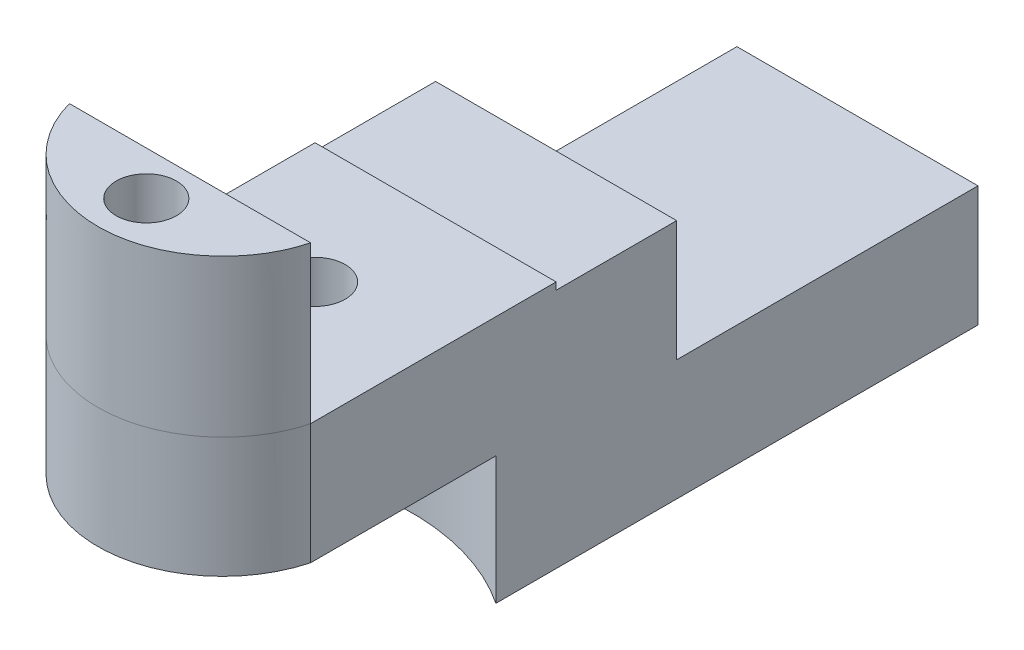
ISO-10303-21;
HEADER;
FILE_DESCRIPTION(('STEP AP214'),'2;1');
FILE_NAME('part.step','',(''),(''),'','','');
FILE_SCHEMA(('AUTOMOTIVE_DESIGN { 1 0 10303 214 1 1 1 1 }'));
ENDSEC;
DATA;
#1=APPLICATION_CONTEXT('core data for automotive mechanical design processes');
#2=APPLICATION_PROTOCOL_DEFINITION('international standard','automotive_design',2000,#1);
#3=PRODUCT_CONTEXT('',#1,'mechanical');
#4=PRODUCT('Part','Part','',(#3));
#5=PRODUCT_RELATED_PRODUCT_CATEGORY('part','',(#4));
#6=PRODUCT_DEFINITION_FORMATION('','',#4);
#7=PRODUCT_DEFINITION_CONTEXT('part definition',#1,'design');
#8=PRODUCT_DEFINITION('design','',#6,#7);
#9=PRODUCT_DEFINITION_SHAPE('','',#8);
#10=(LENGTH_UNIT() NAMED_UNIT(*) SI_UNIT(.MILLI.,.METRE.));
#11=(NAMED_UNIT(*) PLANE_ANGLE_UNIT() SI_UNIT($,.RADIAN.));
#12=(NAMED_UNIT(*) SI_UNIT($,.STERADIAN.) SOLID_ANGLE_UNIT());
#13=UNCERTAINTY_MEASURE_WITH_UNIT(LENGTH_MEASURE(1.E-05),#10,'distance_accuracy_value','');
#14=(GEOMETRIC_REPRESENTATION_CONTEXT(3) GLOBAL_UNCERTAINTY_ASSIGNED_CONTEXT((#13)) GLOBAL_UNIT_ASSIGNED_CONTEXT((#10,
#11,#12)) REPRESENTATION_CONTEXT('',''));
#15=CARTESIAN_POINT('',(0.,0.,0.));
#16=DIRECTION('',(0.,0.,1.));
#17=DIRECTION('',(1.,0.,0.));
#18=AXIS2_PLACEMENT_3D('',#15,#16,#17);
#19=CARTESIAN_POINT('',(0.,0.,-7.62));
#20=DIRECTION('',(0.,0.,1.));
#21=DIRECTION('',(1.,0.,0.));
#22=AXIS2_PLACEMENT_3D('',#19,#20,#21);
#23=PLANE('',#22);
#24=DIRECTION('',(1.,0.,0.));
#25=VECTOR('',#24,1.);
#26=CARTESIAN_POINT('',(2.54,-0.151815502330602,-7.62000000000001));
#27=LINE('',#26,#25);
#28=CARTESIAN_POINT('',(-2.54,-0.151815502330602,-7.62));
#29=VERTEX_POINT('',#28);
#30=CARTESIAN_POINT('',(2.54,-0.151815502330602,-7.62000000000001));
#31=VERTEX_POINT('',#30);
#32=EDGE_CURVE('E56',#29,#31,#27,.T.);
#33=ORIENTED_EDGE('',*,*,#32,.F.);
#34=DIRECTION('',(0.,1.,0.));
#35=VECTOR('',#34,1.);
#36=CARTESIAN_POINT('',(-2.54,-2.6918155023306,-7.62));
#37=LINE('',#36,#35);
#38=CARTESIAN_POINT('',(-2.54,2.3881844976694,-7.62));
#39=VERTEX_POINT('',#38);
#40=EDGE_CURVE('E180',#29,#39,#37,.T.);
#41=ORIENTED_EDGE('',*,*,#40,.T.);
#42=DIRECTION('',(1.,0.,0.));
#43=VECTOR('',#42,1.);
#44=CARTESIAN_POINT('',(2.54,2.3881844976694,-7.62000000000001));
#45=LINE('',#44,#43);
#46=CARTESIAN_POINT('',(2.54,2.3881844976694,-7.62000000000001));
#47=VERTEX_POINT('',#46);
#48=EDGE_CURVE('E182',#39,#47,#45,.T.);
#49=ORIENTED_EDGE('',*,*,#48,.T.);
#50=DIRECTION('',(0.,-1.,0.));
#51=VECTOR('',#50,1.);
#52=CARTESIAN_POINT('',(2.54,-2.6918155023306,-7.62000000000001));
#53=LINE('',#52,#51);
#54=EDGE_CURVE('E184',#47,#31,#53,.T.);
#55=ORIENTED_EDGE('',*,*,#54,.T.);
#56=EDGE_LOOP('',(#33,#41,#49,#55));
#57=FACE_BOUND('',#56,.T.);
#58=ADVANCED_FACE('F40',(#57),#23,.F.);
#59=CARTESIAN_POINT('',(0.,0.,-5.08));
#60=DIRECTION('',(0.,0.,1.));
#61=DIRECTION('',(1.,0.,0.));
#62=AXIS2_PLACEMENT_3D('',#59,#60,#61);
#63=PLANE('',#62);
#64=DIRECTION('',(1.,0.,0.));
#65=VECTOR('',#64,1.);
#66=CARTESIAN_POINT('',(2.54,2.3881844976694,-5.08));
#67=LINE('',#66,#65);
#68=CARTESIAN_POINT('',(-2.54,2.3881844976694,-5.08));
#69=VERTEX_POINT('',#68);
#70=CARTESIAN_POINT('',(2.54,2.3881844976694,-5.08));
#71=VERTEX_POINT('',#70);
#72=EDGE_CURVE('E64',#69,#71,#67,.T.);
#73=ORIENTED_EDGE('',*,*,#72,.F.);
#74=DIRECTION('',(0.,1.,0.));
#75=VECTOR('',#74,1.);
#76=CARTESIAN_POINT('',(-2.54,2.54,-5.08));
#77=LINE('',#76,#75);
#78=CARTESIAN_POINT('',(-2.54,2.54,-5.08));
#79=VERTEX_POINT('',#78);
#80=EDGE_CURVE('E201',#69,#79,#77,.T.);
#81=ORIENTED_EDGE('',*,*,#80,.T.);
#82=DIRECTION('',(1.,0.,0.));
#83=VECTOR('',#82,1.);
#84=CARTESIAN_POINT('',(-2.54,2.54,-5.08));
#85=LINE('',#84,#83);
#86=CARTESIAN_POINT('',(2.54,2.54,-5.08));
#87=VERTEX_POINT('',#86);
#88=EDGE_CURVE('E203',#79,#87,#85,.T.);
#89=ORIENTED_EDGE('',*,*,#88,.T.);
#90=DIRECTION('',(0.,-1.,0.));
#91=VECTOR('',#90,1.);
#92=CARTESIAN_POINT('',(2.54,2.54,-5.08));
#93=LINE('',#92,#91);
#94=EDGE_CURVE('E206',#87,#71,#93,.T.);
#95=ORIENTED_EDGE('',*,*,#94,.T.);
#96=EDGE_LOOP('',(#73,#81,#89,#95));
#97=FACE_BOUND('',#96,.T.);
#98=ADVANCED_FACE('F373',(#97),#63,.F.);
#99=CARTESIAN_POINT('',(1.27,0.,2.53999999999999));
#100=DIRECTION('',(0.,1.,0.));
#101=DIRECTION('',(0.,0.,1.));
#102=AXIS2_PLACEMENT_3D('',#99,#100,#101);
#103=PLANE('',#102);
#104=CARTESIAN_POINT('',(0.,0.,-2.54));
#105=DIRECTION('',(0.,1.,0.));
#106=DIRECTION('',(0.,0.,1.));
#107=AXIS2_PLACEMENT_3D('',#104,#105,#106);
#108=CIRCLE('',#107,0.635);
#109=CARTESIAN_POINT('',(0.,0.,-1.905));
#110=VERTEX_POINT('',#109);
#111=EDGE_CURVE('E298',#110,#110,#108,.T.);
#112=ORIENTED_EDGE('',*,*,#111,.T.);
#113=EDGE_LOOP('',(#112));
#114=FACE_BOUND('',#113,.T.);
#115=CARTESIAN_POINT('',(0.,0.,1.016));
#116=DIRECTION('',(0.,1.,0.));
#117=DIRECTION('',(0.,0.,1.));
#118=AXIS2_PLACEMENT_3D('',#115,#116,#117);
#119=CIRCLE('',#118,0.635);
#120=CARTESIAN_POINT('',(0.,0.,1.651));
#121=VERTEX_POINT('',#120);
#122=EDGE_CURVE('E295',#121,#121,#119,.T.);
#123=ORIENTED_EDGE('',*,*,#122,.T.);
#124=EDGE_LOOP('',(#123));
#125=FACE_BOUND('',#124,.T.);
#126=CARTESIAN_POINT('',(0.,0.,0.));
#127=DIRECTION('',(0.,-1.,0.));
#128=DIRECTION('',(0.,0.,-1.));
#129=AXIS2_PLACEMENT_3D('',#126,#127,#128);
#130=CIRCLE('',#129,4.57905011983927);
#131=CARTESIAN_POINT('',(2.54,0.,-3.81000000000001));
#132=VERTEX_POINT('',#131);
#133=CARTESIAN_POINT('',(-2.54,0.,-3.81));
#134=VERTEX_POINT('',#133);
#135=EDGE_CURVE('E155',#132,#134,#130,.F.);
#136=ORIENTED_EDGE('',*,*,#135,.F.);
#137=DIRECTION('',(0.,0.,-1.));
#138=VECTOR('',#137,1.);
#139=CARTESIAN_POINT('',(2.54,0.,2.53999999999999));
#140=LINE('',#139,#138);
#141=CARTESIAN_POINT('',(2.54,0.,0.0958286786527664));
#142=VERTEX_POINT('',#141);
#143=EDGE_CURVE('E306',#142,#132,#140,.T.);
#144=ORIENTED_EDGE('',*,*,#143,.F.);
#145=CARTESIAN_POINT('',(0.,0.,-0.59200815387328));
#146=DIRECTION('',(0.,1.,0.));
#147=DIRECTION('',(0.,0.,1.));
#148=AXIS2_PLACEMENT_3D('',#145,#146,#147);
#149=CIRCLE('',#148,2.63148617860316);
#150=CARTESIAN_POINT('',(-2.54,0.,0.0958286786527643));
#151=VERTEX_POINT('',#150);
#152=EDGE_CURVE('E286',#151,#142,#149,.T.);
#153=ORIENTED_EDGE('',*,*,#152,.F.);
#154=DIRECTION('',(0.,0.,1.));
#155=VECTOR('',#154,1.);
#156=CARTESIAN_POINT('',(-2.54,0.,2.54));
#157=LINE('',#156,#155);
#158=EDGE_CURVE('E302',#134,#151,#157,.T.);
#159=ORIENTED_EDGE('',*,*,#158,.F.);
#160=EDGE_LOOP('',(#136,#144,#153,#159));
#161=FACE_BOUND('',#160,.T.);
#162=ADVANCED_FACE('F378',(#114,#125,#161),#103,.F.);
#163=CARTESIAN_POINT('',(1.27,2.54,2.53999999999999));
#164=DIRECTION('',(0.,1.,0.));
#165=DIRECTION('',(0.,0.,1.));
#166=AXIS2_PLACEMENT_3D('',#163,#164,#165);
#167=PLANE('',#166);
#168=DIRECTION('',(-1.,0.,0.));
#169=VECTOR('',#168,1.);
#170=CARTESIAN_POINT('',(-2.54,2.54,0.0958286786527643));
#171=LINE('',#170,#169);
#172=CARTESIAN_POINT('',(2.54,2.54,0.0958286786527664));
#173=VERTEX_POINT('',#172);
#174=CARTESIAN_POINT('',(-2.54,2.54,0.0958286786527643));
#175=VERTEX_POINT('',#174);
#176=EDGE_CURVE('E211',#173,#175,#171,.T.);
#177=ORIENTED_EDGE('',*,*,#176,.F.);
#178=DIRECTION('',(0.,0.,-1.));
#179=VECTOR('',#178,1.);
#180=CARTESIAN_POINT('',(2.54,2.54,2.53999999999999));
#181=LINE('',#180,#179);
#182=EDGE_CURVE('E413',#173,#87,#181,.T.);
#183=ORIENTED_EDGE('',*,*,#182,.T.);
#184=ORIENTED_EDGE('',*,*,#88,.F.);
#185=DIRECTION('',(0.,0.,1.));
#186=VECTOR('',#185,1.);
#187=CARTESIAN_POINT('',(-2.54,2.54,2.54));
#188=LINE('',#187,#186);
#189=EDGE_CURVE('E308',#79,#175,#188,.T.);
#190=ORIENTED_EDGE('',*,*,#189,.T.);
#191=EDGE_LOOP('',(#177,#183,#184,#190));
#192=FACE_BOUND('',#191,.T.);
#193=CARTESIAN_POINT('',(0.,2.54,-2.54));
#194=DIRECTION('',(0.,1.,0.));
#195=DIRECTION('',(0.,0.,1.));
#196=AXIS2_PLACEMENT_3D('',#193,#194,#195);
#197=CIRCLE('',#196,0.635);
#198=CARTESIAN_POINT('',(0.,2.54,-1.905));
#199=VERTEX_POINT('',#198);
#200=EDGE_CURVE('E299',#199,#199,#197,.T.);
#201=ORIENTED_EDGE('',*,*,#200,.F.);
#202=EDGE_LOOP('',(#201));
#203=FACE_BOUND('',#202,.T.);
#204=ADVANCED_FACE('F454',(#192,#203),#167,.T.);
#205=CARTESIAN_POINT('',(-2.54,2.54,2.54));
#206=DIRECTION('',(1.,0.,0.));
#207=DIRECTION('',(0.,0.,-1.));
#208=AXIS2_PLACEMENT_3D('',#205,#206,#207);
#209=PLANE('',#208);
#210=DIRECTION('',(0.,-1.,0.));
#211=VECTOR('',#210,1.);
#212=CARTESIAN_POINT('',(-2.54,5.08,0.0958286786527643));
#213=LINE('',#212,#211);
#214=EDGE_CURVE('E294',#175,#151,#213,.T.);
#215=ORIENTED_EDGE('',*,*,#214,.F.);
#216=ORIENTED_EDGE('',*,*,#189,.F.);
#217=ORIENTED_EDGE('',*,*,#80,.F.);
#218=DIRECTION('',(0.,0.,1.));
#219=VECTOR('',#218,1.);
#220=CARTESIAN_POINT('',(-2.54,2.3881844976694,-7.62));
#221=LINE('',#220,#219);
#222=EDGE_CURVE('E190',#39,#69,#221,.T.);
#223=ORIENTED_EDGE('',*,*,#222,.F.);
#224=ORIENTED_EDGE('',*,*,#40,.F.);
#225=DIRECTION('',(0.,0.,1.));
#226=VECTOR('',#225,1.);
#227=CARTESIAN_POINT('',(-2.54000000000001,-0.151815502330602,-13.97));
#228=LINE('',#227,#226);
#229=CARTESIAN_POINT('',(-2.54000000000001,-0.151815502330602,-13.97));
#230=VERTEX_POINT('',#229);
#231=EDGE_CURVE('E177',#230,#29,#228,.T.);
#232=ORIENTED_EDGE('',*,*,#231,.F.);
#233=DIRECTION('',(0.,1.,0.));
#234=VECTOR('',#233,1.);
#235=CARTESIAN_POINT('',(-2.54000000000001,-2.6918155023306,-13.97));
#236=LINE('',#235,#234);
#237=CARTESIAN_POINT('',(-2.54000000000001,-2.6918155023306,-13.97));
#238=VERTEX_POINT('',#237);
#239=EDGE_CURVE('E164',#238,#230,#236,.T.);
#240=ORIENTED_EDGE('',*,*,#239,.F.);
#241=DIRECTION('',(0.,0.,-1.));
#242=VECTOR('',#241,1.);
#243=CARTESIAN_POINT('',(-2.54,-2.6918155023306,0.));
#244=LINE('',#243,#242);
#245=CARTESIAN_POINT('',(-2.54,-2.6918155023306,-3.81));
#246=VERTEX_POINT('',#245);
#247=EDGE_CURVE('E161',#246,#238,#244,.T.);
#248=ORIENTED_EDGE('',*,*,#247,.F.);
#249=DIRECTION('',(0.,1.,0.));
#250=VECTOR('',#249,1.);
#251=CARTESIAN_POINT('',(-2.54,-2.6918155023306,-3.81));
#252=LINE('',#251,#250);
#253=EDGE_CURVE('E195',#246,#134,#252,.T.);
#254=ORIENTED_EDGE('',*,*,#253,.T.);
#255=ORIENTED_EDGE('',*,*,#158,.T.);
#256=EDGE_LOOP('',(#215,#216,#217,#223,#224,#232,#240,#248,#254,#255));
#257=FACE_BOUND('',#256,.T.);
#258=ADVANCED_FACE('F42',(#257),#209,.F.);
#259=CARTESIAN_POINT('',(2.54,2.54,2.53999999999999));
#260=DIRECTION('',(-1.,0.,0.));
#261=DIRECTION('',(0.,0.,1.));
#262=AXIS2_PLACEMENT_3D('',#259,#260,#261);
#263=PLANE('',#262);
#264=DIRECTION('',(0.,-1.,0.));
#265=VECTOR('',#264,1.);
#266=CARTESIAN_POINT('',(2.54,5.08,0.0958286786527664));
#267=LINE('',#266,#265);
#268=EDGE_CURVE('E414',#142,#173,#267,.F.);
#269=ORIENTED_EDGE('',*,*,#268,.F.);
#270=ORIENTED_EDGE('',*,*,#143,.T.);
#271=DIRECTION('',(0.,1.,0.));
#272=VECTOR('',#271,1.);
#273=CARTESIAN_POINT('',(2.54,-2.6918155023306,-3.81));
#274=LINE('',#273,#272);
#275=CARTESIAN_POINT('',(2.54,-2.6918155023306,-3.81));
#276=VERTEX_POINT('',#275);
#277=EDGE_CURVE('E152',#276,#132,#274,.T.);
#278=ORIENTED_EDGE('',*,*,#277,.F.);
#279=DIRECTION('',(0.,0.,1.));
#280=VECTOR('',#279,1.);
#281=CARTESIAN_POINT('',(2.54,-2.6918155023306,0.));
#282=LINE('',#281,#280);
#283=CARTESIAN_POINT('',(2.53999999999999,-2.6918155023306,-13.97));
#284=VERTEX_POINT('',#283);
#285=EDGE_CURVE('E143',#284,#276,#282,.T.);
#286=ORIENTED_EDGE('',*,*,#285,.F.);
#287=DIRECTION('',(0.,-1.,0.));
#288=VECTOR('',#287,1.);
#289=CARTESIAN_POINT('',(2.53999999999999,-2.6918155023306,-13.97));
#290=LINE('',#289,#288);
#291=CARTESIAN_POINT('',(2.53999999999999,-0.151815502330602,-13.97));
#292=VERTEX_POINT('',#291);
#293=EDGE_CURVE('E149',#292,#284,#290,.T.);
#294=ORIENTED_EDGE('',*,*,#293,.F.);
#295=DIRECTION('',(0.,0.,1.));
#296=VECTOR('',#295,1.);
#297=CARTESIAN_POINT('',(2.53999999999999,-0.151815502330602,-13.97));
#298=LINE('',#297,#296);
#299=EDGE_CURVE('E174',#292,#31,#298,.T.);
#300=ORIENTED_EDGE('',*,*,#299,.T.);
#301=ORIENTED_EDGE('',*,*,#54,.F.);
#302=DIRECTION('',(0.,0.,1.));
#303=VECTOR('',#302,1.);
#304=CARTESIAN_POINT('',(2.54,2.3881844976694,-7.62000000000001));
#305=LINE('',#304,#303);
#306=EDGE_CURVE('E186',#47,#71,#305,.T.);
#307=ORIENTED_EDGE('',*,*,#306,.T.);
#308=ORIENTED_EDGE('',*,*,#94,.F.);
#309=ORIENTED_EDGE('',*,*,#182,.F.);
#310=EDGE_LOOP('',(#269,#270,#278,#286,#294,#300,#301,#307,#308,#309));
#311=FACE_BOUND('',#310,.T.);
#312=ADVANCED_FACE('F146',(#311),#263,.F.);
#313=CARTESIAN_POINT('',(0.,2.54,-2.54));
#314=DIRECTION('',(0.,-1.,0.));
#315=DIRECTION('',(0.,0.,-1.));
#316=AXIS2_PLACEMENT_3D('',#313,#314,#315);
#317=CYLINDRICAL_SURFACE('',#316,0.635);
#318=ORIENTED_EDGE('',*,*,#200,.T.);
#319=EDGE_LOOP('',(#318));
#320=FACE_BOUND('',#319,.T.);
#321=ORIENTED_EDGE('',*,*,#111,.F.);
#322=EDGE_LOOP('',(#321));
#323=FACE_BOUND('',#322,.T.);
#324=ADVANCED_FACE('F363',(#320,#323),#317,.F.);
#325=CARTESIAN_POINT('',(0.,2.54,1.016));
#326=DIRECTION('',(0.,-1.,0.));
#327=DIRECTION('',(0.,0.,-1.));
#328=AXIS2_PLACEMENT_3D('',#325,#326,#327);
#329=CYLINDRICAL_SURFACE('',#328,0.635);
#330=ORIENTED_EDGE('',*,*,#122,.F.);
#331=EDGE_LOOP('',(#330));
#332=FACE_BOUND('',#331,.T.);
#333=CARTESIAN_POINT('',(0.,5.842,1.016));
#334=DIRECTION('',(0.,1.,0.));
#335=DIRECTION('',(0.,0.,1.));
#336=AXIS2_PLACEMENT_3D('',#333,#334,#335);
#337=CIRCLE('',#336,0.635);
#338=CARTESIAN_POINT('',(0.,5.842,1.651));
#339=VERTEX_POINT('',#338);
#340=EDGE_CURVE('E208',#339,#339,#337,.T.);
#341=ORIENTED_EDGE('',*,*,#340,.T.);
#342=EDGE_LOOP('',(#341));
#343=FACE_BOUND('',#342,.T.);
#344=ADVANCED_FACE('F361',(#332,#343),#329,.F.);
#345=CARTESIAN_POINT('',(0.,5.08,-0.59200815387328));
#346=DIRECTION('',(0.,-1.,0.));
#347=DIRECTION('',(0.,0.,-1.));
#348=AXIS2_PLACEMENT_3D('',#345,#346,#347);
#349=CYLINDRICAL_SURFACE('',#348,2.63148617860316);
#350=ORIENTED_EDGE('',*,*,#214,.T.);
#351=ORIENTED_EDGE('',*,*,#152,.T.);
#352=ORIENTED_EDGE('',*,*,#268,.T.);
#353=CARTESIAN_POINT('',(2.03958880236766,2.54,1.07075972693147));
#354=CARTESIAN_POINT('',(2.2746981406484,2.54,0.78643244893197));
#355=CARTESIAN_POINT('',(2.4501744449984,2.54,0.454223642627817));
#356=CARTESIAN_POINT('',(2.54,2.54,0.0958286786527666));
#357=B_SPLINE_CURVE_WITH_KNOTS('',3,(#353,#354,#355,#356),.UNSPECIFIED.,.F.,.F.,(4,4),
(0.839156619576607,1.),.UNSPECIFIED.);
#358=CARTESIAN_POINT('',(2.03958880236766,2.54,1.07075972693147));
#359=VERTEX_POINT('',#358);
#360=EDGE_CURVE('E293',#359,#173,#357,.T.);
#361=ORIENTED_EDGE('',*,*,#360,.F.);
#362=CARTESIAN_POINT('',(0.987812837835054,2.54,1.84703782879858));
#363=CARTESIAN_POINT('',(1.39381839169313,2.54,1.68096302200544));
#364=CARTESIAN_POINT('',(1.75913143168598,2.54,1.40992822352944));
#365=CARTESIAN_POINT('',(2.03958880236766,2.54,1.07075972693147));
#366=B_SPLINE_CURVE_WITH_KNOTS('',3,(#362,#363,#364,#365),.UNSPECIFIED.,.F.,.F.,(4,4),
(0.647289669948112,0.839156619576607),.UNSPECIFIED.);
#367=CARTESIAN_POINT('',(0.987812837834838,2.54,1.84703782879866));
#368=VERTEX_POINT('',#367);
#369=EDGE_CURVE('E312',#368,#359,#366,.T.);
#370=ORIENTED_EDGE('',*,*,#369,.F.);
#371=CARTESIAN_POINT('',(0.,2.54,2.03947802472988));
#372=CARTESIAN_POINT('',(0.338558695396626,2.54,2.04053866168749));
#373=CARTESIAN_POINT('',(0.675244728105902,2.54,1.97489245526782));
#374=CARTESIAN_POINT('',(0.987812837835054,2.54,1.84703782879858));
#375=B_SPLINE_CURVE_WITH_KNOTS('',3,(#371,#372,#373,#374),.UNSPECIFIED.,.F.,.F.,(4,4),
(0.499578661576437,0.647289669948112),.UNSPECIFIED.);
#376=CARTESIAN_POINT('',(0.,2.54,2.03947802472988));
#377=VERTEX_POINT('',#376);
#378=EDGE_CURVE('E353',#377,#368,#375,.T.);
#379=ORIENTED_EDGE('',*,*,#378,.F.);
#380=CARTESIAN_POINT('',(-1.42323975499652,2.54,1.62138474120362));
#381=CARTESIAN_POINT('',(-1.0021193736781,2.54,1.89142483475816));
#382=CARTESIAN_POINT('',(-0.499025424485227,2.54,2.03791467747225));
#383=CARTESIAN_POINT('',(0.,2.54,2.03947802472988));
#384=B_SPLINE_CURVE_WITH_KNOTS('',3,(#380,#381,#382,#383),.UNSPECIFIED.,.F.,.F.,(4,4),
(0.28185703854306,0.499578661576437),.UNSPECIFIED.);
#385=CARTESIAN_POINT('',(-1.42323975500321,2.54,1.62138474119932));
#386=VERTEX_POINT('',#385);
#387=EDGE_CURVE('E49',#386,#377,#384,.T.);
#388=ORIENTED_EDGE('',*,*,#387,.F.);
#389=CARTESIAN_POINT('',(-1.59616355918998,2.54,1.50011550415783));
#390=CARTESIAN_POINT('',(-1.54023998398564,2.54,1.5428655654579));
#391=CARTESIAN_POINT('',(-1.48255295078473,2.54,1.58335062637517));
#392=CARTESIAN_POINT('',(-1.42323975499652,2.54,1.62138474120362));
#393=B_SPLINE_CURVE_WITH_KNOTS('',3,(#389,#390,#391,#392),.UNSPECIFIED.,.F.,.F.,(4,4),
(0.251191780276824,0.28185703854306),.UNSPECIFIED.);
#394=CARTESIAN_POINT('',(-1.59616355919016,2.54,1.50011550415769));
#395=VERTEX_POINT('',#394);
#396=EDGE_CURVE('E432',#395,#386,#393,.T.);
#397=ORIENTED_EDGE('',*,*,#396,.F.);
#398=CARTESIAN_POINT('',(-2.27446234412721,2.54,0.731449647995308));
#399=CARTESIAN_POINT('',(-2.10133615366294,2.54,1.02739460622665));
#400=CARTESIAN_POINT('',(-1.86987106021292,2.54,1.29088330817845));
#401=CARTESIAN_POINT('',(-1.59616355918998,2.54,1.50011550415783));
#402=B_SPLINE_CURVE_WITH_KNOTS('',3,(#398,#399,#400,#401),.UNSPECIFIED.,.F.,.F.,(4,4),
(0.101106397187364,0.251191780276824),.UNSPECIFIED.);
#403=CARTESIAN_POINT('',(-2.27446234412721,2.54,0.731449647995308));
#404=VERTEX_POINT('',#403);
#405=EDGE_CURVE('E11',#404,#395,#402,.T.);
#406=ORIENTED_EDGE('',*,*,#405,.F.);
#407=CARTESIAN_POINT('',(-2.54,2.54,0.0958286786527643));
#408=CARTESIAN_POINT('',(-2.48124327317428,2.54,0.317988376803868));
#409=CARTESIAN_POINT('',(-2.39109039288384,2.54,0.532083607967941));
#410=CARTESIAN_POINT('',(-2.27446234412721,2.54,0.731449647995308));
#411=B_SPLINE_CURVE_WITH_KNOTS('',3,(#407,#408,#409,#410),.UNSPECIFIED.,.F.,.F.,(4,4),(0.,
0.101106397187364),.UNSPECIFIED.);
#412=EDGE_CURVE('E282',#175,#404,#411,.T.);
#413=ORIENTED_EDGE('',*,*,#412,.F.);
#414=EDGE_LOOP('',(#350,#351,#352,#361,#370,#379,#388,#397,#406,#413));
#415=FACE_BOUND('',#414,.T.);
#416=ADVANCED_FACE('F233',(#415),#349,.T.);
#417=CARTESIAN_POINT('',(0.00289712010972355,5.842,2.03948547280324));
#418=DIRECTION('',(0.,-1.,0.));
#419=DIRECTION('',(0.,0.,-1.));
#420=AXIS2_PLACEMENT_3D('',#417,#418,#419);
#421=PLANE('',#420);
#422=CARTESIAN_POINT('',(-2.54,5.842,0.0958286786527643));
#423=CARTESIAN_POINT('',(-2.37620228315632,5.842,0.715149278994719));
#424=CARTESIAN_POINT('',(-1.65341238101848,5.842,1.70178270060181));
#425=CARTESIAN_POINT('',(-0.157706480112047,5.842,2.13729921301831));
#426=CARTESIAN_POINT('',(1.47919727727503,5.842,1.81813978403377));
#427=CARTESIAN_POINT('',(2.34302328222455,5.842,0.881746045595831));
#428=CARTESIAN_POINT('',(2.54,5.842,0.0958286786527666));
#429=B_SPLINE_CURVE_WITH_KNOTS('',3,(#422,#423,#424,#425,#426,#427,#428),.UNSPECIFIED.,.F.,.F.,
(4,1,1,1,4),(0.,0.28185703854306,0.499578661576437,0.647289669948112,1.),.UNSPECIFIED.);
#430=CARTESIAN_POINT('',(-2.54,5.842,0.0958286786527643));
#431=VERTEX_POINT('',#430);
#432=CARTESIAN_POINT('',(2.54,5.842,0.0958286786527664));
#433=VERTEX_POINT('',#432);
#434=EDGE_CURVE('E212',#431,#433,#429,.T.);
#435=ORIENTED_EDGE('',*,*,#434,.T.);
#436=DIRECTION('',(-1.,0.,0.));
#437=VECTOR('',#436,1.);
#438=CARTESIAN_POINT('',(-2.54,5.842,0.0958286786527643));
#439=LINE('',#438,#437);
#440=EDGE_CURVE('E218',#433,#431,#439,.T.);
#441=ORIENTED_EDGE('',*,*,#440,.T.);
#442=EDGE_LOOP('',(#435,#441));
#443=FACE_BOUND('',#442,.T.);
#444=ORIENTED_EDGE('',*,*,#340,.F.);
#445=EDGE_LOOP('',(#444));
#446=FACE_BOUND('',#445,.T.);
#447=ADVANCED_FACE('F230',(#443,#446),#421,.F.);
#448=DIRECTION('',(0.,-1.,0.));
#449=VECTOR('',#448,1.);
#450=SURFACE_OF_LINEAR_EXTRUSION('',#429,#449);
#451=ORIENTED_EDGE('',*,*,#412,.T.);
#452=ORIENTED_EDGE('',*,*,#405,.T.);
#453=ORIENTED_EDGE('',*,*,#396,.T.);
#454=ORIENTED_EDGE('',*,*,#387,.T.);
#455=ORIENTED_EDGE('',*,*,#378,.T.);
#456=ORIENTED_EDGE('',*,*,#369,.T.);
#457=ORIENTED_EDGE('',*,*,#360,.T.);
#458=DIRECTION('',(0.,-1.,0.));
#459=VECTOR('',#458,1.);
#460=CARTESIAN_POINT('',(2.54,5.842,0.0958286786527664));
#461=LINE('',#460,#459);
#462=EDGE_CURVE('E277',#433,#173,#461,.T.);
#463=ORIENTED_EDGE('',*,*,#462,.F.);
#464=ORIENTED_EDGE('',*,*,#434,.F.);
#465=DIRECTION('',(0.,-1.,0.));
#466=VECTOR('',#465,1.);
#467=CARTESIAN_POINT('',(-2.54,5.842,0.0958286786527643));
#468=LINE('',#467,#466);
#469=EDGE_CURVE('E269',#431,#175,#468,.T.);
#470=ORIENTED_EDGE('',*,*,#469,.T.);
#471=EDGE_LOOP('',(#451,#452,#453,#454,#455,#456,#457,#463,#464,#470));
#472=FACE_BOUND('',#471,.T.);
#473=ADVANCED_FACE('F224',(#472),#450,.F.);
#474=CARTESIAN_POINT('',(-2.54,5.842,0.0958286786527643));
#475=DIRECTION('',(0.,0.,1.));
#476=DIRECTION('',(1.,0.,0.));
#477=AXIS2_PLACEMENT_3D('',#474,#475,#476);
#478=PLANE('',#477);
#479=ORIENTED_EDGE('',*,*,#176,.T.);
#480=ORIENTED_EDGE('',*,*,#469,.F.);
#481=ORIENTED_EDGE('',*,*,#440,.F.);
#482=ORIENTED_EDGE('',*,*,#462,.T.);
#483=EDGE_LOOP('',(#479,#480,#481,#482));
#484=FACE_BOUND('',#483,.T.);
#485=ADVANCED_FACE('F229',(#484),#478,.F.);
#486=CARTESIAN_POINT('',(0.,-2.6918155023306,0.));
#487=DIRECTION('',(0.,1.,0.));
#488=DIRECTION('',(0.,0.,1.));
#489=AXIS2_PLACEMENT_3D('',#486,#487,#488);
#490=CYLINDRICAL_SURFACE('',#489,4.57905011983927);
#491=ORIENTED_EDGE('',*,*,#135,.T.);
#492=ORIENTED_EDGE('',*,*,#253,.F.);
#493=CARTESIAN_POINT('',(0.,-2.6918155023306,0.));
#494=DIRECTION('',(0.,-1.,0.));
#495=DIRECTION('',(0.,0.,-1.));
#496=AXIS2_PLACEMENT_3D('',#493,#494,#495);
#497=CIRCLE('',#496,4.57905011983927);
#498=EDGE_CURVE('E154',#276,#246,#497,.F.);
#499=ORIENTED_EDGE('',*,*,#498,.F.);
#500=ORIENTED_EDGE('',*,*,#277,.T.);
#501=EDGE_LOOP('',(#491,#492,#499,#500));
#502=FACE_BOUND('',#501,.T.);
#503=ADVANCED_FACE('F390',(#502),#490,.F.);
#504=CARTESIAN_POINT('',(0.,-2.6918155023306,0.));
#505=DIRECTION('',(0.,-1.,0.));
#506=DIRECTION('',(0.,0.,-1.));
#507=AXIS2_PLACEMENT_3D('',#504,#505,#506);
#508=PLANE('',#507);
#509=ORIENTED_EDGE('',*,*,#285,.T.);
#510=ORIENTED_EDGE('',*,*,#498,.T.);
#511=ORIENTED_EDGE('',*,*,#247,.T.);
#512=DIRECTION('',(-1.,0.,0.));
#513=VECTOR('',#512,1.);
#514=CARTESIAN_POINT('',(2.53999999999999,-2.6918155023306,-13.97));
#515=LINE('',#514,#513);
#516=EDGE_CURVE('E158',#284,#238,#515,.T.);
#517=ORIENTED_EDGE('',*,*,#516,.F.);
#518=EDGE_LOOP('',(#509,#510,#511,#517));
#519=FACE_BOUND('',#518,.T.);
#520=ADVANCED_FACE('F159',(#519),#508,.T.);
#521=CARTESIAN_POINT('',(2.54,2.3881844976694,-7.62000000000001));
#522=DIRECTION('',(0.,-1.,0.));
#523=DIRECTION('',(0.,0.,-1.));
#524=AXIS2_PLACEMENT_3D('',#521,#522,#523);
#525=PLANE('',#524);
#526=ORIENTED_EDGE('',*,*,#72,.T.);
#527=ORIENTED_EDGE('',*,*,#306,.F.);
#528=ORIENTED_EDGE('',*,*,#48,.F.);
#529=ORIENTED_EDGE('',*,*,#222,.T.);
#530=EDGE_LOOP('',(#526,#527,#528,#529));
#531=FACE_BOUND('',#530,.T.);
#532=ADVANCED_FACE('F384',(#531),#525,.F.);
#533=CARTESIAN_POINT('',(2.53999999999999,-0.151815502330602,-13.97));
#534=DIRECTION('',(0.,-1.,0.));
#535=DIRECTION('',(0.,0.,-1.));
#536=AXIS2_PLACEMENT_3D('',#533,#534,#535);
#537=PLANE('',#536);
#538=ORIENTED_EDGE('',*,*,#32,.T.);
#539=ORIENTED_EDGE('',*,*,#299,.F.);
#540=DIRECTION('',(1.,0.,0.));
#541=VECTOR('',#540,1.);
#542=CARTESIAN_POINT('',(2.53999999999999,-0.151815502330602,-13.97));
#543=LINE('',#542,#541);
#544=EDGE_CURVE('E168',#230,#292,#543,.T.);
#545=ORIENTED_EDGE('',*,*,#544,.F.);
#546=ORIENTED_EDGE('',*,*,#231,.T.);
#547=EDGE_LOOP('',(#538,#539,#545,#546));
#548=FACE_BOUND('',#547,.T.);
#549=ADVANCED_FACE('F382',(#548),#537,.F.);
#550=CARTESIAN_POINT('',(0.,0.,-13.97));
#551=DIRECTION('',(0.,0.,1.));
#552=DIRECTION('',(1.,0.,0.));
#553=AXIS2_PLACEMENT_3D('',#550,#551,#552);
#554=PLANE('',#553);
#555=ORIENTED_EDGE('',*,*,#293,.T.);
#556=ORIENTED_EDGE('',*,*,#516,.T.);
#557=ORIENTED_EDGE('',*,*,#239,.T.);
#558=ORIENTED_EDGE('',*,*,#544,.T.);
#559=EDGE_LOOP('',(#555,#556,#557,#558));
#560=FACE_BOUND('',#559,.T.);
#561=ADVANCED_FACE('F166',(#560),#554,.F.);
#562=CLOSED_SHELL('',(#58,#98,#162,#204,#258,#312,#324,#344,#416,#447,#473,#485,#503,#520,#532,
#549,#561));
#563=MANIFOLD_SOLID_BREP('B2',#562);
#564=ADVANCED_BREP_SHAPE_REPRESENTATION('',(#18,#563),#14);
#565=SHAPE_DEFINITION_REPRESENTATION(#9,#564);
ENDSEC;
END-ISO-10303-21;
